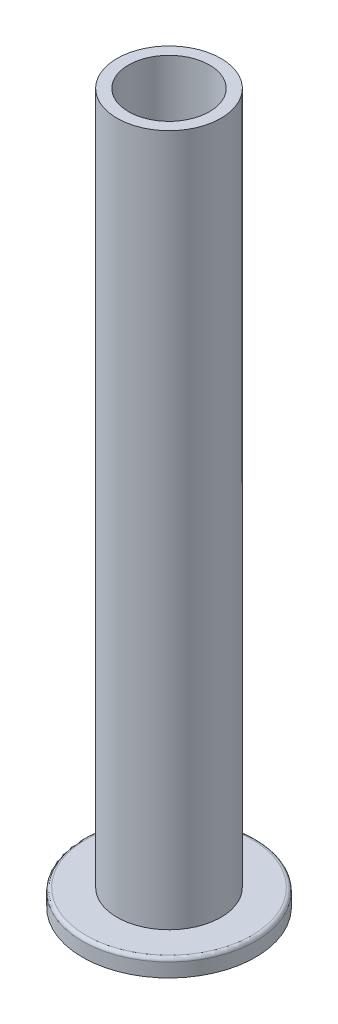
ISO-10303-21;
HEADER;
FILE_DESCRIPTION(('STEP AP214'),'2;1');
FILE_NAME('part.step','',(''),(''),'','','');
FILE_SCHEMA(('AUTOMOTIVE_DESIGN { 1 0 10303 214 1 1 1 1 }'));
ENDSEC;
DATA;
#1=APPLICATION_CONTEXT('core data for automotive mechanical design processes');
#2=APPLICATION_PROTOCOL_DEFINITION('international standard','automotive_design',2000,#1);
#3=PRODUCT_CONTEXT('',#1,'mechanical');
#4=PRODUCT('Part','Part','',(#3));
#5=PRODUCT_RELATED_PRODUCT_CATEGORY('part','',(#4));
#6=PRODUCT_DEFINITION_FORMATION('','',#4);
#7=PRODUCT_DEFINITION_CONTEXT('part definition',#1,'design');
#8=PRODUCT_DEFINITION('design','',#6,#7);
#9=PRODUCT_DEFINITION_SHAPE('','',#8);
#10=(LENGTH_UNIT() NAMED_UNIT(*) SI_UNIT(.MILLI.,.METRE.));
#11=(NAMED_UNIT(*) PLANE_ANGLE_UNIT() SI_UNIT($,.RADIAN.));
#12=(NAMED_UNIT(*) SI_UNIT($,.STERADIAN.) SOLID_ANGLE_UNIT());
#13=UNCERTAINTY_MEASURE_WITH_UNIT(LENGTH_MEASURE(1.E-05),#10,'distance_accuracy_value','');
#14=(GEOMETRIC_REPRESENTATION_CONTEXT(3) GLOBAL_UNCERTAINTY_ASSIGNED_CONTEXT((#13)) GLOBAL_UNIT_ASSIGNED_CONTEXT((#10,
#11,#12)) REPRESENTATION_CONTEXT('',''));
#15=CARTESIAN_POINT('',(0.,0.,0.));
#16=DIRECTION('',(0.,0.,1.));
#17=DIRECTION('',(1.,0.,0.));
#18=AXIS2_PLACEMENT_3D('',#15,#16,#17);
#19=CARTESIAN_POINT('',(0.,-5.,0.));
#20=DIRECTION('',(0.,-1.,0.));
#21=DIRECTION('',(0.,0.,-1.));
#22=AXIS2_PLACEMENT_3D('',#19,#20,#21);
#23=PLANE('',#22);
#24=CARTESIAN_POINT('',(0.,-5.,0.));
#25=DIRECTION('',(0.,1.,0.));
#26=DIRECTION('',(0.,0.,1.));
#27=AXIS2_PLACEMENT_3D('',#24,#25,#26);
#28=CIRCLE('',#27,11.6965594316008);
#29=CARTESIAN_POINT('',(0.,-5.,11.6965594316008));
#30=VERTEX_POINT('',#29);
#31=EDGE_CURVE('E66',#30,#30,#28,.T.);
#32=ORIENTED_EDGE('',*,*,#31,.T.);
#33=EDGE_LOOP('',(#32));
#34=FACE_BOUND('',#33,.T.);
#35=CARTESIAN_POINT('',(0.,-5.,0.));
#36=DIRECTION('',(0.,-1.,0.));
#37=DIRECTION('',(0.,0.,-1.));
#38=AXIS2_PLACEMENT_3D('',#35,#36,#37);
#39=CIRCLE('',#38,25.);
#40=CARTESIAN_POINT('',(0.,-5.,-25.));
#41=VERTEX_POINT('',#40);
#42=EDGE_CURVE('E51',#41,#41,#39,.T.);
#43=ORIENTED_EDGE('',*,*,#42,.T.);
#44=EDGE_LOOP('',(#43));
#45=FACE_BOUND('',#44,.T.);
#46=ADVANCED_FACE('F38',(#34,#45),#23,.T.);
#47=CARTESIAN_POINT('',(0.,0.,0.));
#48=DIRECTION('',(0.,-1.,0.));
#49=DIRECTION('',(0.,0.,-1.));
#50=AXIS2_PLACEMENT_3D('',#47,#48,#49);
#51=CYLINDRICAL_SURFACE('',#50,25.);
#52=CARTESIAN_POINT('',(0.,-1.,0.));
#53=DIRECTION('',(0.,1.,0.));
#54=DIRECTION('',(0.,0.,1.));
#55=AXIS2_PLACEMENT_3D('',#52,#53,#54);
#56=CIRCLE('',#55,25.);
#57=CARTESIAN_POINT('',(0.,-1.,25.));
#58=VERTEX_POINT('',#57);
#59=EDGE_CURVE('E46',#58,#58,#56,.F.);
#60=ORIENTED_EDGE('',*,*,#59,.T.);
#61=EDGE_LOOP('',(#60));
#62=FACE_BOUND('',#61,.T.);
#63=ORIENTED_EDGE('',*,*,#42,.F.);
#64=EDGE_LOOP('',(#63));
#65=FACE_BOUND('',#64,.T.);
#66=ADVANCED_FACE('F97',(#62,#65),#51,.T.);
#67=CARTESIAN_POINT('',(25.,0.,0.));
#68=DIRECTION('',(0.,1.,0.));
#69=DIRECTION('',(0.,0.,1.));
#70=AXIS2_PLACEMENT_3D('',#67,#68,#69);
#71=PLANE('',#70);
#72=CARTESIAN_POINT('',(0.,0.,0.));
#73=DIRECTION('',(0.,1.,0.));
#74=DIRECTION('',(0.,0.,1.));
#75=AXIS2_PLACEMENT_3D('',#72,#73,#74);
#76=CIRCLE('',#75,24.);
#77=CARTESIAN_POINT('',(0.,0.,24.));
#78=VERTEX_POINT('',#77);
#79=EDGE_CURVE('E10',#78,#78,#76,.T.);
#80=ORIENTED_EDGE('',*,*,#79,.T.);
#81=EDGE_LOOP('',(#80));
#82=FACE_BOUND('',#81,.T.);
#83=CARTESIAN_POINT('',(0.,0.,0.));
#84=DIRECTION('',(0.,-1.,0.));
#85=DIRECTION('',(0.,0.,-1.));
#86=AXIS2_PLACEMENT_3D('',#83,#84,#85);
#87=CIRCLE('',#86,15.);
#88=CARTESIAN_POINT('',(0.,0.,-15.));
#89=VERTEX_POINT('',#88);
#90=EDGE_CURVE('E56',#89,#89,#87,.T.);
#91=ORIENTED_EDGE('',*,*,#90,.T.);
#92=EDGE_LOOP('',(#91));
#93=FACE_BOUND('',#92,.T.);
#94=ADVANCED_FACE('F92',(#82,#93),#71,.T.);
#95=CARTESIAN_POINT('',(0.,0.,0.));
#96=DIRECTION('',(0.,-1.,0.));
#97=DIRECTION('',(0.,0.,-1.));
#98=AXIS2_PLACEMENT_3D('',#95,#96,#97);
#99=CYLINDRICAL_SURFACE('',#98,15.);
#100=CARTESIAN_POINT('',(0.,200.,0.));
#101=DIRECTION('',(0.,-1.,0.));
#102=DIRECTION('',(0.,0.,-1.));
#103=AXIS2_PLACEMENT_3D('',#100,#101,#102);
#104=CIRCLE('',#103,15.);
#105=CARTESIAN_POINT('',(0.,200.,-15.));
#106=VERTEX_POINT('',#105);
#107=EDGE_CURVE('E62',#106,#106,#104,.T.);
#108=ORIENTED_EDGE('',*,*,#107,.T.);
#109=EDGE_LOOP('',(#108));
#110=FACE_BOUND('',#109,.T.);
#111=ORIENTED_EDGE('',*,*,#90,.F.);
#112=EDGE_LOOP('',(#111));
#113=FACE_BOUND('',#112,.T.);
#114=ADVANCED_FACE('F86',(#110,#113),#99,.T.);
#115=CARTESIAN_POINT('',(0.,200.,0.));
#116=DIRECTION('',(0.,1.,0.));
#117=DIRECTION('',(0.,0.,1.));
#118=AXIS2_PLACEMENT_3D('',#115,#116,#117);
#119=PLANE('',#118);
#120=CARTESIAN_POINT('',(0.,200.,0.));
#121=DIRECTION('',(0.,1.,0.));
#122=DIRECTION('',(0.,0.,1.));
#123=AXIS2_PLACEMENT_3D('',#120,#121,#122);
#124=CIRCLE('',#123,11.6965594316008);
#125=CARTESIAN_POINT('',(0.,200.,11.6965594316008));
#126=VERTEX_POINT('',#125);
#127=EDGE_CURVE('E67',#126,#126,#124,.T.);
#128=ORIENTED_EDGE('',*,*,#127,.F.);
#129=EDGE_LOOP('',(#128));
#130=FACE_BOUND('',#129,.T.);
#131=ORIENTED_EDGE('',*,*,#107,.F.);
#132=EDGE_LOOP('',(#131));
#133=FACE_BOUND('',#132,.T.);
#134=ADVANCED_FACE('F83',(#130,#133),#119,.T.);
#135=CARTESIAN_POINT('',(0.,-1.,0.));
#136=DIRECTION('',(0.,1.,0.));
#137=DIRECTION('',(0.,0.,1.));
#138=AXIS2_PLACEMENT_3D('',#135,#136,#137);
#139=TOROIDAL_SURFACE('',#138,24.,1.);
#140=ORIENTED_EDGE('',*,*,#79,.F.);
#141=EDGE_LOOP('',(#140));
#142=FACE_BOUND('',#141,.T.);
#143=ORIENTED_EDGE('',*,*,#59,.F.);
#144=EDGE_LOOP('',(#143));
#145=FACE_BOUND('',#144,.T.);
#146=ADVANCED_FACE('F40',(#142,#145),#139,.T.);
#147=CARTESIAN_POINT('',(0.,-5.,0.));
#148=DIRECTION('',(0.,1.,0.));
#149=DIRECTION('',(0.,0.,1.));
#150=AXIS2_PLACEMENT_3D('',#147,#148,#149);
#151=CYLINDRICAL_SURFACE('',#150,11.6965594316008);
#152=ORIENTED_EDGE('',*,*,#31,.F.);
#153=EDGE_LOOP('',(#152));
#154=FACE_BOUND('',#153,.T.);
#155=ORIENTED_EDGE('',*,*,#127,.T.);
#156=EDGE_LOOP('',(#155));
#157=FACE_BOUND('',#156,.T.);
#158=ADVANCED_FACE('F77',(#154,#157),#151,.F.);
#159=CLOSED_SHELL('',(#46,#66,#94,#114,#134,#146,#158));
#160=MANIFOLD_SOLID_BREP('B2',#159);
#161=ADVANCED_BREP_SHAPE_REPRESENTATION('',(#18,#160),#14);
#162=SHAPE_DEFINITION_REPRESENTATION(#9,#161);
ENDSEC;
END-ISO-10303-21;
